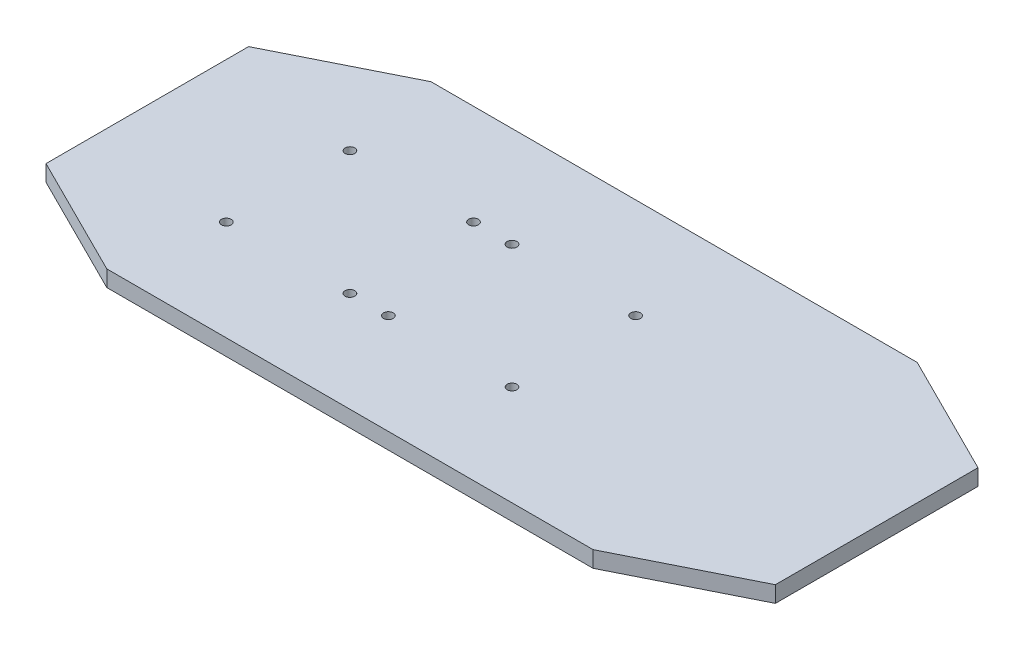
ISO-10303-21;
HEADER;
FILE_DESCRIPTION(('STEP AP214'),'2;1');
FILE_NAME('part.step','',(''),(''),'','','');
FILE_SCHEMA(('AUTOMOTIVE_DESIGN { 1 0 10303 214 1 1 1 1 }'));
ENDSEC;
DATA;
#1=APPLICATION_CONTEXT('core data for automotive mechanical design processes');
#2=APPLICATION_PROTOCOL_DEFINITION('international standard','automotive_design',2000,#1);
#3=PRODUCT_CONTEXT('',#1,'mechanical');
#4=PRODUCT('Part','Part','',(#3));
#5=PRODUCT_RELATED_PRODUCT_CATEGORY('part','',(#4));
#6=PRODUCT_DEFINITION_FORMATION('','',#4);
#7=PRODUCT_DEFINITION_CONTEXT('part definition',#1,'design');
#8=PRODUCT_DEFINITION('design','',#6,#7);
#9=PRODUCT_DEFINITION_SHAPE('','',#8);
#10=(LENGTH_UNIT() NAMED_UNIT(*) SI_UNIT(.MILLI.,.METRE.));
#11=(NAMED_UNIT(*) PLANE_ANGLE_UNIT() SI_UNIT($,.RADIAN.));
#12=(NAMED_UNIT(*) SI_UNIT($,.STERADIAN.) SOLID_ANGLE_UNIT());
#13=UNCERTAINTY_MEASURE_WITH_UNIT(LENGTH_MEASURE(1.E-05),#10,'distance_accuracy_value','');
#14=(GEOMETRIC_REPRESENTATION_CONTEXT(3) GLOBAL_UNCERTAINTY_ASSIGNED_CONTEXT((#13)) GLOBAL_UNIT_ASSIGNED_CONTEXT((#10,
#11,#12)) REPRESENTATION_CONTEXT('',''));
#15=CARTESIAN_POINT('',(0.,0.,0.));
#16=DIRECTION('',(0.,0.,1.));
#17=DIRECTION('',(1.,0.,0.));
#18=AXIS2_PLACEMENT_3D('',#15,#16,#17);
#19=CARTESIAN_POINT('',(0.,4.,0.));
#20=DIRECTION('',(0.,-1.,0.));
#21=DIRECTION('',(0.,0.,-1.));
#22=AXIS2_PLACEMENT_3D('',#19,#20,#21);
#23=PLANE('',#22);
#24=CARTESIAN_POINT('',(34.75,4.,-24.75));
#25=DIRECTION('',(0.,1.,0.));
#26=DIRECTION('',(0.,0.,1.));
#27=AXIS2_PLACEMENT_3D('',#24,#25,#26);
#28=CIRCLE('',#27,1.19999999999999);
#29=CARTESIAN_POINT('',(34.75,4.,-23.55));
#30=VERTEX_POINT('',#29);
#31=EDGE_CURVE('E395',#30,#30,#28,.T.);
#32=ORIENTED_EDGE('',*,*,#31,.F.);
#33=EDGE_LOOP('',(#32));
#34=FACE_BOUND('',#33,.T.);
#35=CARTESIAN_POINT('',(65.25,4.,-24.75));
#36=DIRECTION('',(0.,1.,0.));
#37=DIRECTION('',(0.,0.,1.));
#38=AXIS2_PLACEMENT_3D('',#35,#36,#37);
#39=CIRCLE('',#38,1.19999999999999);
#40=CARTESIAN_POINT('',(65.25,4.,-23.55));
#41=VERTEX_POINT('',#40);
#42=EDGE_CURVE('E389',#41,#41,#39,.T.);
#43=ORIENTED_EDGE('',*,*,#42,.F.);
#44=EDGE_LOOP('',(#43));
#45=FACE_BOUND('',#44,.T.);
#46=CARTESIAN_POINT('',(65.25,4.,-55.25));
#47=DIRECTION('',(0.,1.,0.));
#48=DIRECTION('',(0.,0.,1.));
#49=AXIS2_PLACEMENT_3D('',#46,#47,#48);
#50=CIRCLE('',#49,1.19999999999999);
#51=CARTESIAN_POINT('',(65.25,4.,-54.05));
#52=VERTEX_POINT('',#51);
#53=EDGE_CURVE('E383',#52,#52,#50,.T.);
#54=ORIENTED_EDGE('',*,*,#53,.F.);
#55=EDGE_LOOP('',(#54));
#56=FACE_BOUND('',#55,.T.);
#57=CARTESIAN_POINT('',(34.75,4.,-55.25));
#58=DIRECTION('',(0.,1.,0.));
#59=DIRECTION('',(0.,0.,1.));
#60=AXIS2_PLACEMENT_3D('',#57,#58,#59);
#61=CIRCLE('',#60,1.19999999999999);
#62=CARTESIAN_POINT('',(34.75,4.,-54.05));
#63=VERTEX_POINT('',#62);
#64=EDGE_CURVE('E377',#63,#63,#61,.T.);
#65=ORIENTED_EDGE('',*,*,#64,.F.);
#66=EDGE_LOOP('',(#65));
#67=FACE_BOUND('',#66,.T.);
#68=CARTESIAN_POINT('',(74.75,4.,-55.25));
#69=DIRECTION('',(0.,1.,0.));
#70=DIRECTION('',(0.,0.,1.));
#71=AXIS2_PLACEMENT_3D('',#68,#69,#70);
#72=CIRCLE('',#71,1.19999999999999);
#73=CARTESIAN_POINT('',(74.75,4.,-54.05));
#74=VERTEX_POINT('',#73);
#75=EDGE_CURVE('E371',#74,#74,#72,.T.);
#76=ORIENTED_EDGE('',*,*,#75,.F.);
#77=EDGE_LOOP('',(#76));
#78=FACE_BOUND('',#77,.T.);
#79=CARTESIAN_POINT('',(105.25,4.,-55.25));
#80=DIRECTION('',(0.,1.,0.));
#81=DIRECTION('',(0.,0.,1.));
#82=AXIS2_PLACEMENT_3D('',#79,#80,#81);
#83=CIRCLE('',#82,1.19999999999999);
#84=CARTESIAN_POINT('',(105.25,4.,-54.05));
#85=VERTEX_POINT('',#84);
#86=EDGE_CURVE('E365',#85,#85,#83,.T.);
#87=ORIENTED_EDGE('',*,*,#86,.F.);
#88=EDGE_LOOP('',(#87));
#89=FACE_BOUND('',#88,.T.);
#90=DIRECTION('',(1.,0.,0.));
#91=VECTOR('',#90,1.);
#92=CARTESIAN_POINT('',(0.,4.,0.));
#93=LINE('',#92,#91);
#94=CARTESIAN_POINT('',(30.,4.,0.));
#95=VERTEX_POINT('',#94);
#96=CARTESIAN_POINT('',(150.,4.,0.));
#97=VERTEX_POINT('',#96);
#98=EDGE_CURVE('E140',#95,#97,#93,.T.);
#99=ORIENTED_EDGE('',*,*,#98,.T.);
#100=DIRECTION('',(-0.894427190999916,0.,0.447213595499958));
#101=VECTOR('',#100,1.);
#102=CARTESIAN_POINT('',(180.,4.,-15.));
#103=LINE('',#102,#101);
#104=CARTESIAN_POINT('',(180.,4.,-15.));
#105=VERTEX_POINT('',#104);
#106=EDGE_CURVE('E154',#105,#97,#103,.T.);
#107=ORIENTED_EDGE('',*,*,#106,.F.);
#108=DIRECTION('',(0.,0.,-1.));
#109=VECTOR('',#108,1.);
#110=CARTESIAN_POINT('',(180.,4.,0.));
#111=LINE('',#110,#109);
#112=CARTESIAN_POINT('',(180.,4.,-65.));
#113=VERTEX_POINT('',#112);
#114=EDGE_CURVE('E42',#105,#113,#111,.T.);
#115=ORIENTED_EDGE('',*,*,#114,.T.);
#116=DIRECTION('',(0.894427190999916,0.,0.447213595499958));
#117=VECTOR('',#116,1.);
#118=CARTESIAN_POINT('',(180.,4.,-65.));
#119=LINE('',#118,#117);
#120=CARTESIAN_POINT('',(150.,4.,-80.));
#121=VERTEX_POINT('',#120);
#122=EDGE_CURVE('E152',#121,#113,#119,.T.);
#123=ORIENTED_EDGE('',*,*,#122,.F.);
#124=DIRECTION('',(-1.,0.,0.));
#125=VECTOR('',#124,1.);
#126=CARTESIAN_POINT('',(0.,4.,-80.));
#127=LINE('',#126,#125);
#128=CARTESIAN_POINT('',(30.,4.,-80.));
#129=VERTEX_POINT('',#128);
#130=EDGE_CURVE('E11',#121,#129,#127,.T.);
#131=ORIENTED_EDGE('',*,*,#130,.T.);
#132=DIRECTION('',(0.894427190999916,0.,-0.447213595499958));
#133=VECTOR('',#132,1.);
#134=CARTESIAN_POINT('',(30.,4.,-80.));
#135=LINE('',#134,#133);
#136=CARTESIAN_POINT('',(0.,4.,-65.));
#137=VERTEX_POINT('',#136);
#138=EDGE_CURVE('E110',#137,#129,#135,.T.);
#139=ORIENTED_EDGE('',*,*,#138,.F.);
#140=DIRECTION('',(0.,0.,1.));
#141=VECTOR('',#140,1.);
#142=CARTESIAN_POINT('',(0.,4.,0.));
#143=LINE('',#142,#141);
#144=CARTESIAN_POINT('',(0.,4.,-15.));
#145=VERTEX_POINT('',#144);
#146=EDGE_CURVE('E118',#137,#145,#143,.T.);
#147=ORIENTED_EDGE('',*,*,#146,.T.);
#148=DIRECTION('',(-0.894427190999916,0.,-0.447213595499958));
#149=VECTOR('',#148,1.);
#150=CARTESIAN_POINT('',(0.,4.,-15.));
#151=LINE('',#150,#149);
#152=EDGE_CURVE('E171',#95,#145,#151,.T.);
#153=ORIENTED_EDGE('',*,*,#152,.F.);
#154=EDGE_LOOP('',(#99,#107,#115,#123,#131,#139,#147,#153));
#155=FACE_BOUND('',#154,.T.);
#156=CARTESIAN_POINT('',(74.75,4.,-24.75));
#157=DIRECTION('',(0.,1.,0.));
#158=DIRECTION('',(0.,0.,1.));
#159=AXIS2_PLACEMENT_3D('',#156,#157,#158);
#160=CIRCLE('',#159,1.19999999999999);
#161=CARTESIAN_POINT('',(74.75,4.,-23.55));
#162=VERTEX_POINT('',#161);
#163=EDGE_CURVE('E352',#162,#162,#160,.T.);
#164=ORIENTED_EDGE('',*,*,#163,.F.);
#165=EDGE_LOOP('',(#164));
#166=FACE_BOUND('',#165,.T.);
#167=CARTESIAN_POINT('',(105.25,4.,-24.75));
#168=DIRECTION('',(0.,1.,0.));
#169=DIRECTION('',(0.,0.,1.));
#170=AXIS2_PLACEMENT_3D('',#167,#168,#169);
#171=CIRCLE('',#170,1.19999999999999);
#172=CARTESIAN_POINT('',(105.25,4.,-23.55));
#173=VERTEX_POINT('',#172);
#174=EDGE_CURVE('E357',#173,#173,#171,.T.);
#175=ORIENTED_EDGE('',*,*,#174,.F.);
#176=EDGE_LOOP('',(#175));
#177=FACE_BOUND('',#176,.T.);
#178=ADVANCED_FACE('F33',(#34,#45,#56,#67,#78,#89,#155,#166,#177),#23,.F.);
#179=CARTESIAN_POINT('',(0.,0.,0.));
#180=DIRECTION('',(0.,-1.,0.));
#181=DIRECTION('',(0.,0.,-1.));
#182=AXIS2_PLACEMENT_3D('',#179,#180,#181);
#183=PLANE('',#182);
#184=CARTESIAN_POINT('',(34.75,0.,-24.75));
#185=DIRECTION('',(0.,1.,0.));
#186=DIRECTION('',(0.,0.,1.));
#187=AXIS2_PLACEMENT_3D('',#184,#185,#186);
#188=CIRCLE('',#187,1.2);
#189=CARTESIAN_POINT('',(34.75,0.,-23.55));
#190=VERTEX_POINT('',#189);
#191=EDGE_CURVE('E392',#190,#190,#188,.T.);
#192=ORIENTED_EDGE('',*,*,#191,.T.);
#193=EDGE_LOOP('',(#192));
#194=FACE_BOUND('',#193,.T.);
#195=CARTESIAN_POINT('',(65.25,0.,-24.75));
#196=DIRECTION('',(0.,1.,0.));
#197=DIRECTION('',(0.,0.,1.));
#198=AXIS2_PLACEMENT_3D('',#195,#196,#197);
#199=CIRCLE('',#198,1.19999999999999);
#200=CARTESIAN_POINT('',(65.25,0.,-23.55));
#201=VERTEX_POINT('',#200);
#202=EDGE_CURVE('E386',#201,#201,#199,.T.);
#203=ORIENTED_EDGE('',*,*,#202,.T.);
#204=EDGE_LOOP('',(#203));
#205=FACE_BOUND('',#204,.T.);
#206=CARTESIAN_POINT('',(65.25,0.,-55.25));
#207=DIRECTION('',(0.,1.,0.));
#208=DIRECTION('',(0.,0.,1.));
#209=AXIS2_PLACEMENT_3D('',#206,#207,#208);
#210=CIRCLE('',#209,1.19999999999999);
#211=CARTESIAN_POINT('',(65.25,0.,-54.05));
#212=VERTEX_POINT('',#211);
#213=EDGE_CURVE('E380',#212,#212,#210,.T.);
#214=ORIENTED_EDGE('',*,*,#213,.T.);
#215=EDGE_LOOP('',(#214));
#216=FACE_BOUND('',#215,.T.);
#217=CARTESIAN_POINT('',(34.75,0.,-55.25));
#218=DIRECTION('',(0.,1.,0.));
#219=DIRECTION('',(0.,0.,1.));
#220=AXIS2_PLACEMENT_3D('',#217,#218,#219);
#221=CIRCLE('',#220,1.2);
#222=CARTESIAN_POINT('',(34.75,0.,-54.05));
#223=VERTEX_POINT('',#222);
#224=EDGE_CURVE('E374',#223,#223,#221,.T.);
#225=ORIENTED_EDGE('',*,*,#224,.T.);
#226=EDGE_LOOP('',(#225));
#227=FACE_BOUND('',#226,.T.);
#228=CARTESIAN_POINT('',(74.75,0.,-55.25));
#229=DIRECTION('',(0.,1.,0.));
#230=DIRECTION('',(0.,0.,1.));
#231=AXIS2_PLACEMENT_3D('',#228,#229,#230);
#232=CIRCLE('',#231,1.19999999999999);
#233=CARTESIAN_POINT('',(74.75,0.,-54.05));
#234=VERTEX_POINT('',#233);
#235=EDGE_CURVE('E368',#234,#234,#232,.T.);
#236=ORIENTED_EDGE('',*,*,#235,.T.);
#237=EDGE_LOOP('',(#236));
#238=FACE_BOUND('',#237,.T.);
#239=CARTESIAN_POINT('',(105.25,0.,-55.25));
#240=DIRECTION('',(0.,1.,0.));
#241=DIRECTION('',(0.,0.,1.));
#242=AXIS2_PLACEMENT_3D('',#239,#240,#241);
#243=CIRCLE('',#242,1.19999999999999);
#244=CARTESIAN_POINT('',(105.25,0.,-54.05));
#245=VERTEX_POINT('',#244);
#246=EDGE_CURVE('E362',#245,#245,#243,.T.);
#247=ORIENTED_EDGE('',*,*,#246,.T.);
#248=EDGE_LOOP('',(#247));
#249=FACE_BOUND('',#248,.T.);
#250=CARTESIAN_POINT('',(105.25,0.,-24.75));
#251=DIRECTION('',(0.,1.,0.));
#252=DIRECTION('',(0.,0.,1.));
#253=AXIS2_PLACEMENT_3D('',#250,#251,#252);
#254=CIRCLE('',#253,1.19999999999999);
#255=CARTESIAN_POINT('',(105.25,0.,-23.55));
#256=VERTEX_POINT('',#255);
#257=EDGE_CURVE('E353',#256,#256,#254,.T.);
#258=ORIENTED_EDGE('',*,*,#257,.T.);
#259=EDGE_LOOP('',(#258));
#260=FACE_BOUND('',#259,.T.);
#261=DIRECTION('',(-0.894427190999916,0.,0.447213595499958));
#262=VECTOR('',#261,1.);
#263=CARTESIAN_POINT('',(180.,0.,-15.));
#264=LINE('',#263,#262);
#265=CARTESIAN_POINT('',(180.,0.,-15.));
#266=VERTEX_POINT('',#265);
#267=CARTESIAN_POINT('',(150.,0.,0.));
#268=VERTEX_POINT('',#267);
#269=EDGE_CURVE('E164',#266,#268,#264,.T.);
#270=ORIENTED_EDGE('',*,*,#269,.T.);
#271=DIRECTION('',(1.,0.,0.));
#272=VECTOR('',#271,1.);
#273=CARTESIAN_POINT('',(0.,0.,0.));
#274=LINE('',#273,#272);
#275=CARTESIAN_POINT('',(30.,0.,0.));
#276=VERTEX_POINT('',#275);
#277=EDGE_CURVE('E125',#276,#268,#274,.T.);
#278=ORIENTED_EDGE('',*,*,#277,.F.);
#279=DIRECTION('',(-0.894427190999916,0.,-0.447213595499958));
#280=VECTOR('',#279,1.);
#281=CARTESIAN_POINT('',(0.,0.,-15.));
#282=LINE('',#281,#280);
#283=CARTESIAN_POINT('',(0.,0.,-15.));
#284=VERTEX_POINT('',#283);
#285=EDGE_CURVE('E124',#276,#284,#282,.T.);
#286=ORIENTED_EDGE('',*,*,#285,.T.);
#287=DIRECTION('',(0.,0.,1.));
#288=VECTOR('',#287,1.);
#289=CARTESIAN_POINT('',(0.,0.,0.));
#290=LINE('',#289,#288);
#291=CARTESIAN_POINT('',(0.,0.,-65.));
#292=VERTEX_POINT('',#291);
#293=EDGE_CURVE('E116',#292,#284,#290,.T.);
#294=ORIENTED_EDGE('',*,*,#293,.F.);
#295=DIRECTION('',(0.894427190999916,0.,-0.447213595499958));
#296=VECTOR('',#295,1.);
#297=CARTESIAN_POINT('',(30.,0.,-80.));
#298=LINE('',#297,#296);
#299=CARTESIAN_POINT('',(30.0000000000001,0.,-80.));
#300=VERTEX_POINT('',#299);
#301=EDGE_CURVE('E99',#292,#300,#298,.T.);
#302=ORIENTED_EDGE('',*,*,#301,.T.);
#303=DIRECTION('',(-1.,0.,0.));
#304=VECTOR('',#303,1.);
#305=CARTESIAN_POINT('',(0.,0.,-80.));
#306=LINE('',#305,#304);
#307=CARTESIAN_POINT('',(150.,0.,-80.));
#308=VERTEX_POINT('',#307);
#309=EDGE_CURVE('E37',#308,#300,#306,.T.);
#310=ORIENTED_EDGE('',*,*,#309,.F.);
#311=DIRECTION('',(0.894427190999916,0.,0.447213595499958));
#312=VECTOR('',#311,1.);
#313=CARTESIAN_POINT('',(180.,0.,-65.));
#314=LINE('',#313,#312);
#315=CARTESIAN_POINT('',(180.,0.,-65.));
#316=VERTEX_POINT('',#315);
#317=EDGE_CURVE('E158',#308,#316,#314,.T.);
#318=ORIENTED_EDGE('',*,*,#317,.T.);
#319=DIRECTION('',(0.,0.,-1.));
#320=VECTOR('',#319,1.);
#321=CARTESIAN_POINT('',(180.,0.,0.));
#322=LINE('',#321,#320);
#323=EDGE_CURVE('E129',#266,#316,#322,.T.);
#324=ORIENTED_EDGE('',*,*,#323,.F.);
#325=EDGE_LOOP('',(#270,#278,#286,#294,#302,#310,#318,#324));
#326=FACE_BOUND('',#325,.T.);
#327=CARTESIAN_POINT('',(74.75,0.,-24.75));
#328=DIRECTION('',(0.,1.,0.));
#329=DIRECTION('',(0.,0.,1.));
#330=AXIS2_PLACEMENT_3D('',#327,#328,#329);
#331=CIRCLE('',#330,1.19999999999999);
#332=CARTESIAN_POINT('',(74.75,0.,-23.55));
#333=VERTEX_POINT('',#332);
#334=EDGE_CURVE('E167',#333,#333,#331,.T.);
#335=ORIENTED_EDGE('',*,*,#334,.T.);
#336=EDGE_LOOP('',(#335));
#337=FACE_BOUND('',#336,.T.);
#338=ADVANCED_FACE('F121',(#194,#205,#216,#227,#238,#249,#260,#326,#337),#183,.T.);
#339=CARTESIAN_POINT('',(0.,4.,0.));
#340=DIRECTION('',(1.,0.,0.));
#341=DIRECTION('',(0.,0.,-1.));
#342=AXIS2_PLACEMENT_3D('',#339,#340,#341);
#343=PLANE('',#342);
#344=ORIENTED_EDGE('',*,*,#146,.F.);
#345=DIRECTION('',(0.,1.,0.));
#346=VECTOR('',#345,1.);
#347=CARTESIAN_POINT('',(0.,0.,-65.));
#348=LINE('',#347,#346);
#349=EDGE_CURVE('E102',#292,#137,#348,.T.);
#350=ORIENTED_EDGE('',*,*,#349,.F.);
#351=ORIENTED_EDGE('',*,*,#293,.T.);
#352=DIRECTION('',(0.,1.,0.));
#353=VECTOR('',#352,1.);
#354=CARTESIAN_POINT('',(0.,0.,-15.));
#355=LINE('',#354,#353);
#356=EDGE_CURVE('E126',#284,#145,#355,.T.);
#357=ORIENTED_EDGE('',*,*,#356,.T.);
#358=EDGE_LOOP('',(#344,#350,#351,#357));
#359=FACE_BOUND('',#358,.T.);
#360=ADVANCED_FACE('F35',(#359),#343,.F.);
#361=CARTESIAN_POINT('',(0.,4.,0.));
#362=DIRECTION('',(0.,0.,-1.));
#363=DIRECTION('',(-1.,0.,0.));
#364=AXIS2_PLACEMENT_3D('',#361,#362,#363);
#365=PLANE('',#364);
#366=ORIENTED_EDGE('',*,*,#277,.T.);
#367=DIRECTION('',(0.,1.,0.));
#368=VECTOR('',#367,1.);
#369=CARTESIAN_POINT('',(150.,0.,0.));
#370=LINE('',#369,#368);
#371=EDGE_CURVE('E50',#268,#97,#370,.T.);
#372=ORIENTED_EDGE('',*,*,#371,.T.);
#373=ORIENTED_EDGE('',*,*,#98,.F.);
#374=DIRECTION('',(0.,1.,0.));
#375=VECTOR('',#374,1.);
#376=CARTESIAN_POINT('',(30.,0.,0.));
#377=LINE('',#376,#375);
#378=EDGE_CURVE('E131',#276,#95,#377,.T.);
#379=ORIENTED_EDGE('',*,*,#378,.F.);
#380=EDGE_LOOP('',(#366,#372,#373,#379));
#381=FACE_BOUND('',#380,.T.);
#382=ADVANCED_FACE('F179',(#381),#365,.F.);
#383=CARTESIAN_POINT('',(180.,4.,0.));
#384=DIRECTION('',(-1.,0.,0.));
#385=DIRECTION('',(0.,0.,1.));
#386=AXIS2_PLACEMENT_3D('',#383,#384,#385);
#387=PLANE('',#386);
#388=ORIENTED_EDGE('',*,*,#114,.F.);
#389=DIRECTION('',(0.,1.,0.));
#390=VECTOR('',#389,1.);
#391=CARTESIAN_POINT('',(180.,0.,-15.));
#392=LINE('',#391,#390);
#393=EDGE_CURVE('E156',#266,#105,#392,.T.);
#394=ORIENTED_EDGE('',*,*,#393,.F.);
#395=ORIENTED_EDGE('',*,*,#323,.T.);
#396=DIRECTION('',(0.,1.,0.));
#397=VECTOR('',#396,1.);
#398=CARTESIAN_POINT('',(180.,0.,-65.));
#399=LINE('',#398,#397);
#400=EDGE_CURVE('E58',#316,#113,#399,.T.);
#401=ORIENTED_EDGE('',*,*,#400,.T.);
#402=EDGE_LOOP('',(#388,#394,#395,#401));
#403=FACE_BOUND('',#402,.T.);
#404=ADVANCED_FACE('F155',(#403),#387,.F.);
#405=CARTESIAN_POINT('',(0.,4.,-80.));
#406=DIRECTION('',(0.,0.,1.));
#407=DIRECTION('',(1.,0.,0.));
#408=AXIS2_PLACEMENT_3D('',#405,#406,#407);
#409=PLANE('',#408);
#410=ORIENTED_EDGE('',*,*,#130,.F.);
#411=DIRECTION('',(0.,1.,0.));
#412=VECTOR('',#411,1.);
#413=CARTESIAN_POINT('',(150.,0.,-80.));
#414=LINE('',#413,#412);
#415=EDGE_CURVE('E157',#308,#121,#414,.T.);
#416=ORIENTED_EDGE('',*,*,#415,.F.);
#417=ORIENTED_EDGE('',*,*,#309,.T.);
#418=DIRECTION('',(0.,1.,0.));
#419=VECTOR('',#418,1.);
#420=CARTESIAN_POINT('',(30.,0.,-80.));
#421=LINE('',#420,#419);
#422=EDGE_CURVE('E105',#300,#129,#421,.T.);
#423=ORIENTED_EDGE('',*,*,#422,.T.);
#424=EDGE_LOOP('',(#410,#416,#417,#423));
#425=FACE_BOUND('',#424,.T.);
#426=ADVANCED_FACE('F176',(#425),#409,.F.);
#427=CARTESIAN_POINT('',(0.,0.,-15.));
#428=DIRECTION('',(0.447213595499958,0.,-0.894427190999916));
#429=DIRECTION('',(-0.894427190999916,0.,-0.447213595499958));
#430=AXIS2_PLACEMENT_3D('',#427,#428,#429);
#431=PLANE('',#430);
#432=ORIENTED_EDGE('',*,*,#152,.T.);
#433=ORIENTED_EDGE('',*,*,#356,.F.);
#434=ORIENTED_EDGE('',*,*,#285,.F.);
#435=ORIENTED_EDGE('',*,*,#378,.T.);
#436=EDGE_LOOP('',(#432,#433,#434,#435));
#437=FACE_BOUND('',#436,.T.);
#438=ADVANCED_FACE('F181',(#437),#431,.F.);
#439=CARTESIAN_POINT('',(30.,0.,-80.));
#440=DIRECTION('',(0.447213595499958,0.,0.894427190999916));
#441=DIRECTION('',(0.894427190999916,0.,-0.447213595499958));
#442=AXIS2_PLACEMENT_3D('',#439,#440,#441);
#443=PLANE('',#442);
#444=ORIENTED_EDGE('',*,*,#138,.T.);
#445=ORIENTED_EDGE('',*,*,#422,.F.);
#446=ORIENTED_EDGE('',*,*,#301,.F.);
#447=ORIENTED_EDGE('',*,*,#349,.T.);
#448=EDGE_LOOP('',(#444,#445,#446,#447));
#449=FACE_BOUND('',#448,.T.);
#450=ADVANCED_FACE('F101',(#449),#443,.F.);
#451=CARTESIAN_POINT('',(180.,0.,-65.));
#452=DIRECTION('',(-0.447213595499958,0.,0.894427190999916));
#453=DIRECTION('',(0.894427190999916,0.,0.447213595499958));
#454=AXIS2_PLACEMENT_3D('',#451,#452,#453);
#455=PLANE('',#454);
#456=ORIENTED_EDGE('',*,*,#122,.T.);
#457=ORIENTED_EDGE('',*,*,#400,.F.);
#458=ORIENTED_EDGE('',*,*,#317,.F.);
#459=ORIENTED_EDGE('',*,*,#415,.T.);
#460=EDGE_LOOP('',(#456,#457,#458,#459));
#461=FACE_BOUND('',#460,.T.);
#462=ADVANCED_FACE('F175',(#461),#455,.F.);
#463=CARTESIAN_POINT('',(180.,0.,-15.));
#464=DIRECTION('',(-0.447213595499958,0.,-0.894427190999916));
#465=DIRECTION('',(-0.894427190999916,0.,0.447213595499958));
#466=AXIS2_PLACEMENT_3D('',#463,#464,#465);
#467=PLANE('',#466);
#468=ORIENTED_EDGE('',*,*,#106,.T.);
#469=ORIENTED_EDGE('',*,*,#371,.F.);
#470=ORIENTED_EDGE('',*,*,#269,.F.);
#471=ORIENTED_EDGE('',*,*,#393,.T.);
#472=EDGE_LOOP('',(#468,#469,#470,#471));
#473=FACE_BOUND('',#472,.T.);
#474=ADVANCED_FACE('F279',(#473),#467,.F.);
#475=CARTESIAN_POINT('',(74.75,4.,-24.75));
#476=DIRECTION('',(0.,1.,0.));
#477=DIRECTION('',(0.,0.,1.));
#478=AXIS2_PLACEMENT_3D('',#475,#476,#477);
#479=CYLINDRICAL_SURFACE('',#478,1.19999999999999);
#480=ORIENTED_EDGE('',*,*,#334,.F.);
#481=EDGE_LOOP('',(#480));
#482=FACE_BOUND('',#481,.T.);
#483=ORIENTED_EDGE('',*,*,#163,.T.);
#484=EDGE_LOOP('',(#483));
#485=FACE_BOUND('',#484,.T.);
#486=ADVANCED_FACE('F276',(#482,#485),#479,.F.);
#487=CARTESIAN_POINT('',(105.25,4.,-24.75));
#488=DIRECTION('',(0.,1.,0.));
#489=DIRECTION('',(0.,0.,1.));
#490=AXIS2_PLACEMENT_3D('',#487,#488,#489);
#491=CYLINDRICAL_SURFACE('',#490,1.19999999999999);
#492=ORIENTED_EDGE('',*,*,#257,.F.);
#493=EDGE_LOOP('',(#492));
#494=FACE_BOUND('',#493,.T.);
#495=ORIENTED_EDGE('',*,*,#174,.T.);
#496=EDGE_LOOP('',(#495));
#497=FACE_BOUND('',#496,.T.);
#498=ADVANCED_FACE('F272',(#494,#497),#491,.F.);
#499=CARTESIAN_POINT('',(105.25,4.,-55.25));
#500=DIRECTION('',(0.,1.,0.));
#501=DIRECTION('',(0.,0.,1.));
#502=AXIS2_PLACEMENT_3D('',#499,#500,#501);
#503=CYLINDRICAL_SURFACE('',#502,1.19999999999999);
#504=ORIENTED_EDGE('',*,*,#246,.F.);
#505=EDGE_LOOP('',(#504));
#506=FACE_BOUND('',#505,.T.);
#507=ORIENTED_EDGE('',*,*,#86,.T.);
#508=EDGE_LOOP('',(#507));
#509=FACE_BOUND('',#508,.T.);
#510=ADVANCED_FACE('F268',(#506,#509),#503,.F.);
#511=CARTESIAN_POINT('',(74.75,4.,-55.25));
#512=DIRECTION('',(0.,1.,0.));
#513=DIRECTION('',(0.,0.,1.));
#514=AXIS2_PLACEMENT_3D('',#511,#512,#513);
#515=CYLINDRICAL_SURFACE('',#514,1.19999999999999);
#516=ORIENTED_EDGE('',*,*,#235,.F.);
#517=EDGE_LOOP('',(#516));
#518=FACE_BOUND('',#517,.T.);
#519=ORIENTED_EDGE('',*,*,#75,.T.);
#520=EDGE_LOOP('',(#519));
#521=FACE_BOUND('',#520,.T.);
#522=ADVANCED_FACE('F228',(#518,#521),#515,.F.);
#523=CARTESIAN_POINT('',(34.75,4.,-55.25));
#524=DIRECTION('',(0.,1.,0.));
#525=DIRECTION('',(0.,0.,1.));
#526=AXIS2_PLACEMENT_3D('',#523,#524,#525);
#527=CYLINDRICAL_SURFACE('',#526,1.19999999999999);
#528=ORIENTED_EDGE('',*,*,#224,.F.);
#529=EDGE_LOOP('',(#528));
#530=FACE_BOUND('',#529,.T.);
#531=ORIENTED_EDGE('',*,*,#64,.T.);
#532=EDGE_LOOP('',(#531));
#533=FACE_BOUND('',#532,.T.);
#534=ADVANCED_FACE('F222',(#530,#533),#527,.F.);
#535=CARTESIAN_POINT('',(65.25,4.,-55.25));
#536=DIRECTION('',(0.,1.,0.));
#537=DIRECTION('',(0.,0.,1.));
#538=AXIS2_PLACEMENT_3D('',#535,#536,#537);
#539=CYLINDRICAL_SURFACE('',#538,1.19999999999999);
#540=ORIENTED_EDGE('',*,*,#213,.F.);
#541=EDGE_LOOP('',(#540));
#542=FACE_BOUND('',#541,.T.);
#543=ORIENTED_EDGE('',*,*,#53,.T.);
#544=EDGE_LOOP('',(#543));
#545=FACE_BOUND('',#544,.T.);
#546=ADVANCED_FACE('F227',(#542,#545),#539,.F.);
#547=CARTESIAN_POINT('',(65.25,4.,-24.75));
#548=DIRECTION('',(0.,1.,0.));
#549=DIRECTION('',(0.,0.,1.));
#550=AXIS2_PLACEMENT_3D('',#547,#548,#549);
#551=CYLINDRICAL_SURFACE('',#550,1.19999999999999);
#552=ORIENTED_EDGE('',*,*,#202,.F.);
#553=EDGE_LOOP('',(#552));
#554=FACE_BOUND('',#553,.T.);
#555=ORIENTED_EDGE('',*,*,#42,.T.);
#556=EDGE_LOOP('',(#555));
#557=FACE_BOUND('',#556,.T.);
#558=ADVANCED_FACE('F240',(#554,#557),#551,.F.);
#559=CARTESIAN_POINT('',(34.75,4.,-24.75));
#560=DIRECTION('',(0.,1.,0.));
#561=DIRECTION('',(0.,0.,1.));
#562=AXIS2_PLACEMENT_3D('',#559,#560,#561);
#563=CYLINDRICAL_SURFACE('',#562,1.19999999999999);
#564=ORIENTED_EDGE('',*,*,#191,.F.);
#565=EDGE_LOOP('',(#564));
#566=FACE_BOUND('',#565,.T.);
#567=ORIENTED_EDGE('',*,*,#31,.T.);
#568=EDGE_LOOP('',(#567));
#569=FACE_BOUND('',#568,.T.);
#570=ADVANCED_FACE('F250',(#566,#569),#563,.F.);
#571=CLOSED_SHELL('',(#178,#338,#360,#382,#404,#426,#438,#450,#462,#474,#486,#498,#510,#522,
#534,#546,#558,#570));
#572=MANIFOLD_SOLID_BREP('B2',#571);
#573=ADVANCED_BREP_SHAPE_REPRESENTATION('',(#18,#572),#14);
#574=SHAPE_DEFINITION_REPRESENTATION(#9,#573);
ENDSEC;
END-ISO-10303-21;
